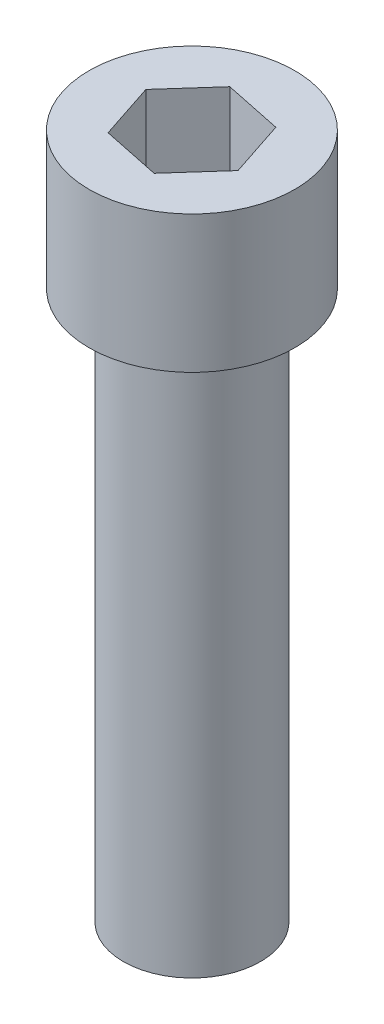
ISO-10303-21;
HEADER;
FILE_DESCRIPTION(('STEP AP214'),'2;1');
FILE_NAME('part.step','',(''),(''),'','','');
FILE_SCHEMA(('AUTOMOTIVE_DESIGN { 1 0 10303 214 1 1 1 1 }'));
ENDSEC;
DATA;
#1=APPLICATION_CONTEXT('core data for automotive mechanical design processes');
#2=APPLICATION_PROTOCOL_DEFINITION('international standard','automotive_design',2000,#1);
#3=PRODUCT_CONTEXT('',#1,'mechanical');
#4=PRODUCT('Part','Part','',(#3));
#5=PRODUCT_RELATED_PRODUCT_CATEGORY('part','',(#4));
#6=PRODUCT_DEFINITION_FORMATION('','',#4);
#7=PRODUCT_DEFINITION_CONTEXT('part definition',#1,'design');
#8=PRODUCT_DEFINITION('design','',#6,#7);
#9=PRODUCT_DEFINITION_SHAPE('','',#8);
#10=(LENGTH_UNIT() NAMED_UNIT(*) SI_UNIT(.MILLI.,.METRE.));
#11=(NAMED_UNIT(*) PLANE_ANGLE_UNIT() SI_UNIT($,.RADIAN.));
#12=(NAMED_UNIT(*) SI_UNIT($,.STERADIAN.) SOLID_ANGLE_UNIT());
#13=UNCERTAINTY_MEASURE_WITH_UNIT(LENGTH_MEASURE(1.E-05),#10,'distance_accuracy_value','');
#14=(GEOMETRIC_REPRESENTATION_CONTEXT(3) GLOBAL_UNCERTAINTY_ASSIGNED_CONTEXT((#13)) GLOBAL_UNIT_ASSIGNED_CONTEXT((#10,
#11,#12)) REPRESENTATION_CONTEXT('',''));
#15=CARTESIAN_POINT('',(0.,0.,0.));
#16=DIRECTION('',(0.,0.,1.));
#17=DIRECTION('',(1.,0.,0.));
#18=AXIS2_PLACEMENT_3D('',#15,#16,#17);
#19=CARTESIAN_POINT('',(0.,25.4,0.));
#20=DIRECTION('',(0.,-1.,0.));
#21=DIRECTION('',(0.,0.,-1.));
#22=AXIS2_PLACEMENT_3D('',#19,#20,#21);
#23=CYLINDRICAL_SURFACE('',#22,3.175);
#24=CARTESIAN_POINT('',(0.,25.4,0.));
#25=DIRECTION('',(0.,1.,0.));
#26=DIRECTION('',(0.,0.,1.));
#27=AXIS2_PLACEMENT_3D('',#24,#25,#26);
#28=CIRCLE('',#27,3.175);
#29=CARTESIAN_POINT('',(0.,25.4,3.175));
#30=VERTEX_POINT('',#29);
#31=EDGE_CURVE('E11',#30,#30,#28,.T.);
#32=ORIENTED_EDGE('',*,*,#31,.F.);
#33=EDGE_LOOP('',(#32));
#34=FACE_BOUND('',#33,.T.);
#35=CARTESIAN_POINT('',(0.,0.,0.));
#36=DIRECTION('',(0.,1.,0.));
#37=DIRECTION('',(0.,0.,1.));
#38=AXIS2_PLACEMENT_3D('',#35,#36,#37);
#39=CIRCLE('',#38,3.175);
#40=CARTESIAN_POINT('',(0.,0.,3.175));
#41=VERTEX_POINT('',#40);
#42=EDGE_CURVE('E34',#41,#41,#39,.T.);
#43=ORIENTED_EDGE('',*,*,#42,.T.);
#44=EDGE_LOOP('',(#43));
#45=FACE_BOUND('',#44,.T.);
#46=ADVANCED_FACE('F31',(#34,#45),#23,.T.);
#47=CARTESIAN_POINT('',(0.,0.,0.));
#48=DIRECTION('',(0.,1.,0.));
#49=DIRECTION('',(0.,0.,1.));
#50=AXIS2_PLACEMENT_3D('',#47,#48,#49);
#51=PLANE('',#50);
#52=ORIENTED_EDGE('',*,*,#42,.F.);
#53=EDGE_LOOP('',(#52));
#54=FACE_BOUND('',#53,.T.);
#55=ADVANCED_FACE('F149',(#54),#51,.F.);
#56=CARTESIAN_POINT('',(0.,25.4,0.));
#57=DIRECTION('',(0.,1.,0.));
#58=DIRECTION('',(0.,0.,1.));
#59=AXIS2_PLACEMENT_3D('',#56,#57,#58);
#60=PLANE('',#59);
#61=CARTESIAN_POINT('',(0.,25.4,0.));
#62=DIRECTION('',(0.,1.,0.));
#63=DIRECTION('',(0.,0.,1.));
#64=AXIS2_PLACEMENT_3D('',#61,#62,#63);
#65=CIRCLE('',#64,4.7625);
#66=CARTESIAN_POINT('',(0.,25.4,4.7625));
#67=VERTEX_POINT('',#66);
#68=EDGE_CURVE('E132',#67,#67,#65,.T.);
#69=ORIENTED_EDGE('',*,*,#68,.F.);
#70=EDGE_LOOP('',(#69));
#71=FACE_BOUND('',#70,.T.);
#72=ORIENTED_EDGE('',*,*,#31,.T.);
#73=EDGE_LOOP('',(#72));
#74=FACE_BOUND('',#73,.T.);
#75=ADVANCED_FACE('F146',(#71,#74),#60,.F.);
#76=CARTESIAN_POINT('',(0.,31.75,0.));
#77=DIRECTION('',(0.,-1.,0.));
#78=DIRECTION('',(0.,0.,-1.));
#79=AXIS2_PLACEMENT_3D('',#76,#77,#78);
#80=CYLINDRICAL_SURFACE('',#79,4.7625);
#81=CARTESIAN_POINT('',(0.,31.75,0.));
#82=DIRECTION('',(0.,1.,0.));
#83=DIRECTION('',(0.,0.,1.));
#84=AXIS2_PLACEMENT_3D('',#81,#82,#83);
#85=CIRCLE('',#84,4.7625);
#86=CARTESIAN_POINT('',(0.,31.75,4.7625));
#87=VERTEX_POINT('',#86);
#88=EDGE_CURVE('E138',#87,#87,#85,.T.);
#89=ORIENTED_EDGE('',*,*,#88,.F.);
#90=EDGE_LOOP('',(#89));
#91=FACE_BOUND('',#90,.T.);
#92=ORIENTED_EDGE('',*,*,#68,.T.);
#93=EDGE_LOOP('',(#92));
#94=FACE_BOUND('',#93,.T.);
#95=ADVANCED_FACE('F144',(#91,#94),#80,.T.);
#96=CARTESIAN_POINT('',(0.,31.75,0.));
#97=DIRECTION('',(0.,1.,0.));
#98=DIRECTION('',(0.,0.,1.));
#99=AXIS2_PLACEMENT_3D('',#96,#97,#98);
#100=PLANE('',#99);
#101=DIRECTION('',(-0.665882927585627,0.,0.746056249052305));
#102=VECTOR('',#101,1.);
#103=CARTESIAN_POINT('',(-0.86108038721943,31.75,-2.6113232884394));
#104=LINE('',#103,#102);
#105=CARTESIAN_POINT('',(-0.86108038721943,31.75,-2.6113232884394));
#106=VERTEX_POINT('',#105);
#107=CARTESIAN_POINT('',(-2.69201249889216,31.75,-0.559944154187134));
#108=VERTEX_POINT('',#107);
#109=EDGE_CURVE('E45',#106,#108,#104,.T.);
#110=ORIENTED_EDGE('',*,*,#109,.F.);
#111=DIRECTION('',(-0.979045128124239,0.,-0.203643406709354));
#112=VECTOR('',#111,1.);
#113=CARTESIAN_POINT('',(1.83093211167273,31.75,-2.05137913425227));
#114=LINE('',#113,#112);
#115=CARTESIAN_POINT('',(1.83093211167273,31.75,-2.05137913425227));
#116=VERTEX_POINT('',#115);
#117=EDGE_CURVE('E128',#116,#106,#114,.T.);
#118=ORIENTED_EDGE('',*,*,#117,.F.);
#119=DIRECTION('',(-0.313162200538613,0.,-0.949699655761659));
#120=VECTOR('',#119,1.);
#121=CARTESIAN_POINT('',(2.69201249889216,31.75,0.559944154187132));
#122=LINE('',#121,#120);
#123=CARTESIAN_POINT('',(2.69201249889216,31.75,0.559944154187132));
#124=VERTEX_POINT('',#123);
#125=EDGE_CURVE('E126',#124,#116,#122,.T.);
#126=ORIENTED_EDGE('',*,*,#125,.F.);
#127=DIRECTION('',(0.665882927585627,0.,-0.746056249052305));
#128=VECTOR('',#127,1.);
#129=CARTESIAN_POINT('',(0.86108038721943,31.75,2.6113232884394));
#130=LINE('',#129,#128);
#131=CARTESIAN_POINT('',(0.86108038721943,31.75,2.6113232884394));
#132=VERTEX_POINT('',#131);
#133=EDGE_CURVE('E93',#132,#124,#130,.T.);
#134=ORIENTED_EDGE('',*,*,#133,.F.);
#135=DIRECTION('',(0.979045128124239,0.,0.203643406709355));
#136=VECTOR('',#135,1.);
#137=CARTESIAN_POINT('',(-1.83093211167273,31.75,2.05137913425227));
#138=LINE('',#137,#136);
#139=CARTESIAN_POINT('',(-1.83093211167273,31.75,2.05137913425227));
#140=VERTEX_POINT('',#139);
#141=EDGE_CURVE('E122',#140,#132,#138,.T.);
#142=ORIENTED_EDGE('',*,*,#141,.F.);
#143=DIRECTION('',(0.313162200538612,0.,0.949699655761659));
#144=VECTOR('',#143,1.);
#145=CARTESIAN_POINT('',(-2.69201249889216,31.75,-0.559944154187134));
#146=LINE('',#145,#144);
#147=EDGE_CURVE('E119',#108,#140,#146,.T.);
#148=ORIENTED_EDGE('',*,*,#147,.F.);
#149=EDGE_LOOP('',(#110,#118,#126,#134,#142,#148));
#150=FACE_BOUND('',#149,.T.);
#151=ORIENTED_EDGE('',*,*,#88,.T.);
#152=EDGE_LOOP('',(#151));
#153=FACE_BOUND('',#152,.T.);
#154=ADVANCED_FACE('F163',(#150,#153),#100,.T.);
#155=CARTESIAN_POINT('',(-0.86108038721943,25.4,-2.6113232884394));
#156=DIRECTION('',(-0.746056249052305,0.,-0.665882927585627));
#157=DIRECTION('',(-0.665882927585627,0.,0.746056249052305));
#158=AXIS2_PLACEMENT_3D('',#155,#156,#157);
#159=PLANE('',#158);
#160=ORIENTED_EDGE('',*,*,#109,.T.);
#161=DIRECTION('',(0.,1.,0.));
#162=VECTOR('',#161,1.);
#163=CARTESIAN_POINT('',(-2.69201249889216,25.4,-0.559944154187134));
#164=LINE('',#163,#162);
#165=CARTESIAN_POINT('',(-2.69201249889216,25.4,-0.559944154187134));
#166=VERTEX_POINT('',#165);
#167=EDGE_CURVE('E75',#166,#108,#164,.T.);
#168=ORIENTED_EDGE('',*,*,#167,.F.);
#169=DIRECTION('',(-0.665882927585627,0.,0.746056249052305));
#170=VECTOR('',#169,1.);
#171=CARTESIAN_POINT('',(-0.86108038721943,25.4,-2.6113232884394));
#172=LINE('',#171,#170);
#173=CARTESIAN_POINT('',(-0.86108038721943,25.4,-2.6113232884394));
#174=VERTEX_POINT('',#173);
#175=EDGE_CURVE('E130',#174,#166,#172,.T.);
#176=ORIENTED_EDGE('',*,*,#175,.F.);
#177=DIRECTION('',(0.,1.,0.));
#178=VECTOR('',#177,1.);
#179=CARTESIAN_POINT('',(-0.86108038721943,25.4,-2.6113232884394));
#180=LINE('',#179,#178);
#181=EDGE_CURVE('E53',#174,#106,#180,.T.);
#182=ORIENTED_EDGE('',*,*,#181,.T.);
#183=EDGE_LOOP('',(#160,#168,#176,#182));
#184=FACE_BOUND('',#183,.T.);
#185=ADVANCED_FACE('F168',(#184),#159,.F.);
#186=CARTESIAN_POINT('',(1.83093211167273,25.4,-2.05137913425227));
#187=DIRECTION('',(0.203643406709354,0.,-0.979045128124239));
#188=DIRECTION('',(-0.979045128124239,0.,-0.203643406709354));
#189=AXIS2_PLACEMENT_3D('',#186,#187,#188);
#190=PLANE('',#189);
#191=ORIENTED_EDGE('',*,*,#117,.T.);
#192=ORIENTED_EDGE('',*,*,#181,.F.);
#193=DIRECTION('',(-0.979045128124239,0.,-0.203643406709354));
#194=VECTOR('',#193,1.);
#195=CARTESIAN_POINT('',(1.83093211167273,25.4,-2.05137913425227));
#196=LINE('',#195,#194);
#197=CARTESIAN_POINT('',(1.83093211167273,25.4,-2.05137913425227));
#198=VERTEX_POINT('',#197);
#199=EDGE_CURVE('E105',#198,#174,#196,.T.);
#200=ORIENTED_EDGE('',*,*,#199,.F.);
#201=DIRECTION('',(0.,1.,0.));
#202=VECTOR('',#201,1.);
#203=CARTESIAN_POINT('',(1.83093211167273,25.4,-2.05137913425227));
#204=LINE('',#203,#202);
#205=EDGE_CURVE('E97',#198,#116,#204,.T.);
#206=ORIENTED_EDGE('',*,*,#205,.T.);
#207=EDGE_LOOP('',(#191,#192,#200,#206));
#208=FACE_BOUND('',#207,.T.);
#209=ADVANCED_FACE('F172',(#208),#190,.F.);
#210=CARTESIAN_POINT('',(2.69201249889216,25.4,0.559944154187132));
#211=DIRECTION('',(0.949699655761659,0.,-0.313162200538612));
#212=DIRECTION('',(-0.313162200538612,0.,-0.949699655761659));
#213=AXIS2_PLACEMENT_3D('',#210,#211,#212);
#214=PLANE('',#213);
#215=ORIENTED_EDGE('',*,*,#125,.T.);
#216=ORIENTED_EDGE('',*,*,#205,.F.);
#217=DIRECTION('',(-0.313162200538613,0.,-0.949699655761659));
#218=VECTOR('',#217,1.);
#219=CARTESIAN_POINT('',(2.69201249889216,25.4,0.559944154187132));
#220=LINE('',#219,#218);
#221=CARTESIAN_POINT('',(2.69201249889216,25.4,0.559944154187132));
#222=VERTEX_POINT('',#221);
#223=EDGE_CURVE('E101',#222,#198,#220,.T.);
#224=ORIENTED_EDGE('',*,*,#223,.F.);
#225=DIRECTION('',(0.,1.,0.));
#226=VECTOR('',#225,1.);
#227=CARTESIAN_POINT('',(2.69201249889216,25.4,0.559944154187132));
#228=LINE('',#227,#226);
#229=EDGE_CURVE('E86',#222,#124,#228,.T.);
#230=ORIENTED_EDGE('',*,*,#229,.T.);
#231=EDGE_LOOP('',(#215,#216,#224,#230));
#232=FACE_BOUND('',#231,.T.);
#233=ADVANCED_FACE('F102',(#232),#214,.F.);
#234=CARTESIAN_POINT('',(0.86108038721943,25.4,2.6113232884394));
#235=DIRECTION('',(0.746056249052305,0.,0.665882927585627));
#236=DIRECTION('',(0.665882927585627,0.,-0.746056249052305));
#237=AXIS2_PLACEMENT_3D('',#234,#235,#236);
#238=PLANE('',#237);
#239=ORIENTED_EDGE('',*,*,#133,.T.);
#240=ORIENTED_EDGE('',*,*,#229,.F.);
#241=DIRECTION('',(0.665882927585627,0.,-0.746056249052305));
#242=VECTOR('',#241,1.);
#243=CARTESIAN_POINT('',(0.86108038721943,25.4,2.6113232884394));
#244=LINE('',#243,#242);
#245=CARTESIAN_POINT('',(0.86108038721943,25.4,2.6113232884394));
#246=VERTEX_POINT('',#245);
#247=EDGE_CURVE('E90',#246,#222,#244,.T.);
#248=ORIENTED_EDGE('',*,*,#247,.F.);
#249=DIRECTION('',(0.,1.,0.));
#250=VECTOR('',#249,1.);
#251=CARTESIAN_POINT('',(0.86108038721943,25.4,2.6113232884394));
#252=LINE('',#251,#250);
#253=EDGE_CURVE('E98',#246,#132,#252,.T.);
#254=ORIENTED_EDGE('',*,*,#253,.T.);
#255=EDGE_LOOP('',(#239,#240,#248,#254));
#256=FACE_BOUND('',#255,.T.);
#257=ADVANCED_FACE('F88',(#256),#238,.F.);
#258=CARTESIAN_POINT('',(-1.83093211167273,25.4,2.05137913425227));
#259=DIRECTION('',(-0.203643406709355,0.,0.979045128124239));
#260=DIRECTION('',(0.979045128124239,0.,0.203643406709355));
#261=AXIS2_PLACEMENT_3D('',#258,#259,#260);
#262=PLANE('',#261);
#263=ORIENTED_EDGE('',*,*,#141,.T.);
#264=ORIENTED_EDGE('',*,*,#253,.F.);
#265=DIRECTION('',(0.979045128124239,0.,0.203643406709355));
#266=VECTOR('',#265,1.);
#267=CARTESIAN_POINT('',(-1.83093211167273,25.4,2.05137913425227));
#268=LINE('',#267,#266);
#269=CARTESIAN_POINT('',(-1.83093211167273,25.4,2.05137913425227));
#270=VERTEX_POINT('',#269);
#271=EDGE_CURVE('E111',#270,#246,#268,.T.);
#272=ORIENTED_EDGE('',*,*,#271,.F.);
#273=DIRECTION('',(0.,1.,0.));
#274=VECTOR('',#273,1.);
#275=CARTESIAN_POINT('',(-1.83093211167273,25.4,2.05137913425227));
#276=LINE('',#275,#274);
#277=EDGE_CURVE('E135',#270,#140,#276,.T.);
#278=ORIENTED_EDGE('',*,*,#277,.T.);
#279=EDGE_LOOP('',(#263,#264,#272,#278));
#280=FACE_BOUND('',#279,.T.);
#281=ADVANCED_FACE('F176',(#280),#262,.F.);
#282=CARTESIAN_POINT('',(-2.69201249889216,25.4,-0.559944154187134));
#283=DIRECTION('',(-0.949699655761659,0.,0.313162200538612));
#284=DIRECTION('',(0.313162200538612,0.,0.949699655761659));
#285=AXIS2_PLACEMENT_3D('',#282,#283,#284);
#286=PLANE('',#285);
#287=ORIENTED_EDGE('',*,*,#147,.T.);
#288=ORIENTED_EDGE('',*,*,#277,.F.);
#289=DIRECTION('',(0.313162200538612,0.,0.949699655761659));
#290=VECTOR('',#289,1.);
#291=CARTESIAN_POINT('',(-2.69201249889216,25.4,-0.559944154187134));
#292=LINE('',#291,#290);
#293=EDGE_CURVE('E113',#166,#270,#292,.T.);
#294=ORIENTED_EDGE('',*,*,#293,.F.);
#295=ORIENTED_EDGE('',*,*,#167,.T.);
#296=EDGE_LOOP('',(#287,#288,#294,#295));
#297=FACE_BOUND('',#296,.T.);
#298=ADVANCED_FACE('F173',(#297),#286,.F.);
#299=CARTESIAN_POINT('',(-2.69201249889216,25.4,-0.559944154187133));
#300=DIRECTION('',(0.,1.,0.));
#301=DIRECTION('',(0.,0.,1.));
#302=AXIS2_PLACEMENT_3D('',#299,#300,#301);
#303=PLANE('',#302);
#304=ORIENTED_EDGE('',*,*,#175,.T.);
#305=ORIENTED_EDGE('',*,*,#293,.T.);
#306=ORIENTED_EDGE('',*,*,#271,.T.);
#307=ORIENTED_EDGE('',*,*,#247,.T.);
#308=ORIENTED_EDGE('',*,*,#223,.T.);
#309=ORIENTED_EDGE('',*,*,#199,.T.);
#310=EDGE_LOOP('',(#304,#305,#306,#307,#308,#309));
#311=FACE_BOUND('',#310,.T.);
#312=ADVANCED_FACE('F108',(#311),#303,.T.);
#313=CLOSED_SHELL('',(#46,#55,#75,#95,#154,#185,#209,#233,#257,#281,#298,#312));
#314=MANIFOLD_SOLID_BREP('B2',#313);
#315=ADVANCED_BREP_SHAPE_REPRESENTATION('',(#18,#314),#14);
#316=SHAPE_DEFINITION_REPRESENTATION(#9,#315);
ENDSEC;
END-ISO-10303-21;
